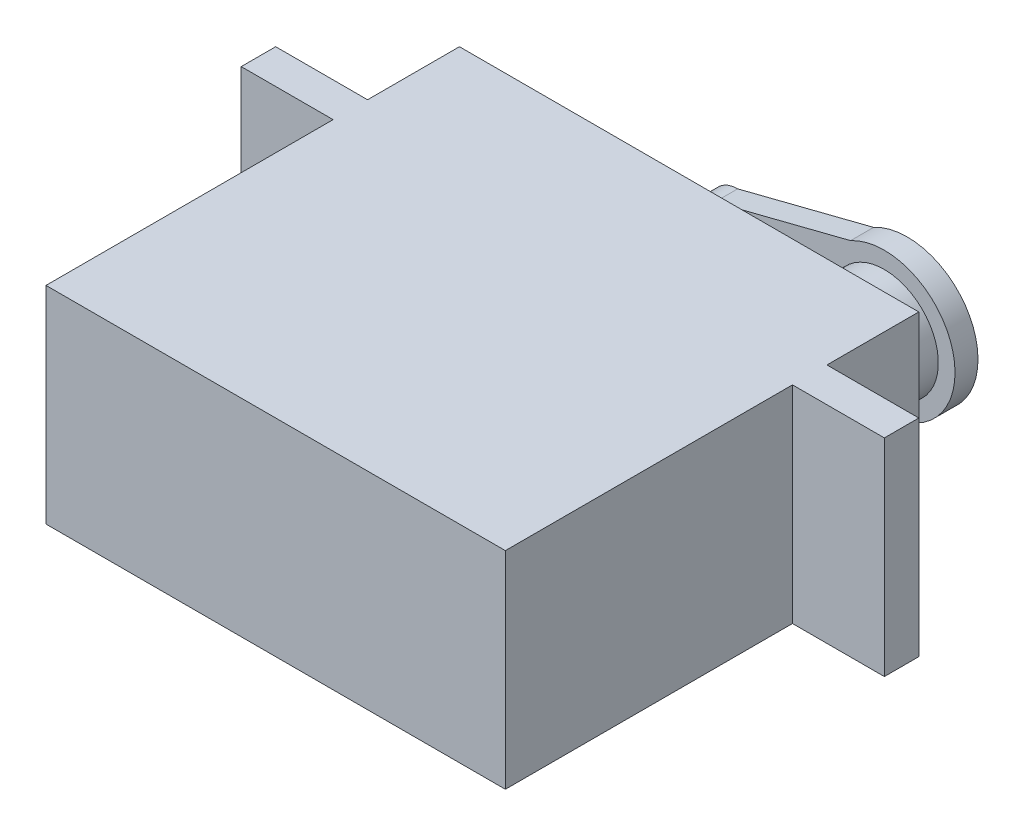
ISO-10303-21;
HEADER;
FILE_DESCRIPTION(('STEP AP214'),'2;1');
FILE_NAME('part.step','',(''),(''),'','','');
FILE_SCHEMA(('AUTOMOTIVE_DESIGN { 1 0 10303 214 1 1 1 1 }'));
ENDSEC;
DATA;
#1=APPLICATION_CONTEXT('core data for automotive mechanical design processes');
#2=APPLICATION_PROTOCOL_DEFINITION('international standard','automotive_design',2000,#1);
#3=PRODUCT_CONTEXT('',#1,'mechanical');
#4=PRODUCT('Part','Part','',(#3));
#5=PRODUCT_RELATED_PRODUCT_CATEGORY('part','',(#4));
#6=PRODUCT_DEFINITION_FORMATION('','',#4);
#7=PRODUCT_DEFINITION_CONTEXT('part definition',#1,'design');
#8=PRODUCT_DEFINITION('design','',#6,#7);
#9=PRODUCT_DEFINITION_SHAPE('','',#8);
#10=(LENGTH_UNIT() NAMED_UNIT(*) SI_UNIT(.MILLI.,.METRE.));
#11=(NAMED_UNIT(*) PLANE_ANGLE_UNIT() SI_UNIT($,.RADIAN.));
#12=(NAMED_UNIT(*) SI_UNIT($,.STERADIAN.) SOLID_ANGLE_UNIT());
#13=UNCERTAINTY_MEASURE_WITH_UNIT(LENGTH_MEASURE(1.E-05),#10,'distance_accuracy_value','');
#14=(GEOMETRIC_REPRESENTATION_CONTEXT(3) GLOBAL_UNCERTAINTY_ASSIGNED_CONTEXT((#13)) GLOBAL_UNIT_ASSIGNED_CONTEXT((#10,
#11,#12)) REPRESENTATION_CONTEXT('',''));
#15=CARTESIAN_POINT('',(0.,0.,0.));
#16=DIRECTION('',(0.,0.,1.));
#17=DIRECTION('',(1.,0.,0.));
#18=AXIS2_PLACEMENT_3D('',#15,#16,#17);
#19=CARTESIAN_POINT('',(0.,0.,0.));
#20=DIRECTION('',(0.,0.,1.));
#21=DIRECTION('',(1.,0.,0.));
#22=AXIS2_PLACEMENT_3D('',#19,#20,#21);
#23=PLANE('',#22);
#24=DIRECTION('',(1.,0.,0.));
#25=VECTOR('',#24,1.);
#26=CARTESIAN_POINT('',(-56.,0.,0.));
#27=LINE('',#26,#25);
#28=CARTESIAN_POINT('',(-8.,0.,0.));
#29=VERTEX_POINT('',#28);
#30=CARTESIAN_POINT('',(0.,0.,0.));
#31=VERTEX_POINT('',#30);
#32=EDGE_CURVE('E256',#29,#31,#27,.T.);
#33=ORIENTED_EDGE('',*,*,#32,.F.);
#34=DIRECTION('',(0.,1.,0.));
#35=VECTOR('',#34,1.);
#36=CARTESIAN_POINT('',(-8.,0.,0.));
#37=LINE('',#36,#35);
#38=CARTESIAN_POINT('',(-8.,18.,0.));
#39=VERTEX_POINT('',#38);
#40=EDGE_CURVE('E189',#29,#39,#37,.T.);
#41=ORIENTED_EDGE('',*,*,#40,.T.);
#42=DIRECTION('',(-1.,0.,0.));
#43=VECTOR('',#42,1.);
#44=CARTESIAN_POINT('',(0.,18.,0.));
#45=LINE('',#44,#43);
#46=CARTESIAN_POINT('',(0.,18.,0.));
#47=VERTEX_POINT('',#46);
#48=EDGE_CURVE('E251',#47,#39,#45,.T.);
#49=ORIENTED_EDGE('',*,*,#48,.F.);
#50=DIRECTION('',(0.,1.,0.));
#51=VECTOR('',#50,1.);
#52=CARTESIAN_POINT('',(0.,0.,0.));
#53=LINE('',#52,#51);
#54=EDGE_CURVE('E232',#31,#47,#53,.T.);
#55=ORIENTED_EDGE('',*,*,#54,.F.);
#56=EDGE_LOOP('',(#33,#41,#49,#55));
#57=FACE_BOUND('',#56,.T.);
#58=ADVANCED_FACE('F37',(#57),#23,.F.);
#59=CARTESIAN_POINT('',(0.,0.,3.));
#60=DIRECTION('',(0.,0.,1.));
#61=DIRECTION('',(1.,0.,0.));
#62=AXIS2_PLACEMENT_3D('',#59,#60,#61);
#63=PLANE('',#62);
#64=DIRECTION('',(1.,0.,0.));
#65=VECTOR('',#64,1.);
#66=CARTESIAN_POINT('',(-56.,0.,3.));
#67=LINE('',#66,#65);
#68=CARTESIAN_POINT('',(-56.,0.,3.));
#69=VERTEX_POINT('',#68);
#70=CARTESIAN_POINT('',(-48.,0.,3.));
#71=VERTEX_POINT('',#70);
#72=EDGE_CURVE('E244',#69,#71,#67,.T.);
#73=ORIENTED_EDGE('',*,*,#72,.T.);
#74=DIRECTION('',(0.,1.,0.));
#75=VECTOR('',#74,1.);
#76=CARTESIAN_POINT('',(-48.,0.,3.));
#77=LINE('',#76,#75);
#78=CARTESIAN_POINT('',(-48.,18.,3.));
#79=VERTEX_POINT('',#78);
#80=EDGE_CURVE('E211',#71,#79,#77,.T.);
#81=ORIENTED_EDGE('',*,*,#80,.T.);
#82=DIRECTION('',(-1.,0.,0.));
#83=VECTOR('',#82,1.);
#84=CARTESIAN_POINT('',(0.,18.,3.));
#85=LINE('',#84,#83);
#86=CARTESIAN_POINT('',(-56.,18.,3.));
#87=VERTEX_POINT('',#86);
#88=EDGE_CURVE('E236',#79,#87,#85,.T.);
#89=ORIENTED_EDGE('',*,*,#88,.T.);
#90=DIRECTION('',(0.,-1.,0.));
#91=VECTOR('',#90,1.);
#92=CARTESIAN_POINT('',(-56.,18.,3.));
#93=LINE('',#92,#91);
#94=EDGE_CURVE('E241',#87,#69,#93,.T.);
#95=ORIENTED_EDGE('',*,*,#94,.T.);
#96=EDGE_LOOP('',(#73,#81,#89,#95));
#97=FACE_BOUND('',#96,.T.);
#98=ADVANCED_FACE('F283',(#97),#63,.T.);
#99=CARTESIAN_POINT('',(0.,18.,3.));
#100=VERTEX_POINT('',#99);
#101=CARTESIAN_POINT('',(-8.,18.,3.));
#102=VERTEX_POINT('',#101);
#103=EDGE_CURVE('E238',#100,#102,#85,.T.);
#104=ORIENTED_EDGE('',*,*,#103,.T.);
#105=DIRECTION('',(0.,-1.,0.));
#106=VECTOR('',#105,1.);
#107=CARTESIAN_POINT('',(-8.,0.,3.));
#108=LINE('',#107,#106);
#109=CARTESIAN_POINT('',(-8.,0.,3.));
#110=VERTEX_POINT('',#109);
#111=EDGE_CURVE('E216',#102,#110,#108,.T.);
#112=ORIENTED_EDGE('',*,*,#111,.T.);
#113=CARTESIAN_POINT('',(0.,0.,3.));
#114=VERTEX_POINT('',#113);
#115=EDGE_CURVE('E243',#110,#114,#67,.T.);
#116=ORIENTED_EDGE('',*,*,#115,.T.);
#117=DIRECTION('',(0.,1.,0.));
#118=VECTOR('',#117,1.);
#119=CARTESIAN_POINT('',(0.,0.,3.));
#120=LINE('',#119,#118);
#121=EDGE_CURVE('E233',#114,#100,#120,.T.);
#122=ORIENTED_EDGE('',*,*,#121,.T.);
#123=EDGE_LOOP('',(#104,#112,#116,#122));
#124=FACE_BOUND('',#123,.T.);
#125=ADVANCED_FACE('F297',(#124),#63,.T.);
#126=CARTESIAN_POINT('',(0.,0.,3.));
#127=DIRECTION('',(-1.,0.,0.));
#128=DIRECTION('',(0.,0.,1.));
#129=AXIS2_PLACEMENT_3D('',#126,#127,#128);
#130=PLANE('',#129);
#131=ORIENTED_EDGE('',*,*,#54,.T.);
#132=DIRECTION('',(0.,0.,-1.));
#133=VECTOR('',#132,1.);
#134=CARTESIAN_POINT('',(0.,18.,3.));
#135=LINE('',#134,#133);
#136=EDGE_CURVE('E11',#100,#47,#135,.T.);
#137=ORIENTED_EDGE('',*,*,#136,.F.);
#138=ORIENTED_EDGE('',*,*,#121,.F.);
#139=DIRECTION('',(0.,0.,-1.));
#140=VECTOR('',#139,1.);
#141=CARTESIAN_POINT('',(0.,0.,3.));
#142=LINE('',#141,#140);
#143=EDGE_CURVE('E247',#114,#31,#142,.T.);
#144=ORIENTED_EDGE('',*,*,#143,.T.);
#145=EDGE_LOOP('',(#131,#137,#138,#144));
#146=FACE_BOUND('',#145,.T.);
#147=ADVANCED_FACE('F39',(#146),#130,.F.);
#148=CARTESIAN_POINT('',(0.,18.,3.));
#149=DIRECTION('',(0.,-1.,0.));
#150=DIRECTION('',(1.,0.,0.));
#151=AXIS2_PLACEMENT_3D('',#148,#149,#150);
#152=PLANE('',#151);
#153=ORIENTED_EDGE('',*,*,#48,.T.);
#154=DIRECTION('',(0.,0.,1.));
#155=VECTOR('',#154,1.);
#156=CARTESIAN_POINT('',(-8.,18.,-8.));
#157=LINE('',#156,#155);
#158=CARTESIAN_POINT('',(-8.,18.,-8.));
#159=VERTEX_POINT('',#158);
#160=EDGE_CURVE('E201',#159,#39,#157,.T.);
#161=ORIENTED_EDGE('',*,*,#160,.F.);
#162=DIRECTION('',(1.,0.,0.));
#163=VECTOR('',#162,1.);
#164=CARTESIAN_POINT('',(0.,18.,-8.));
#165=LINE('',#164,#163);
#166=CARTESIAN_POINT('',(-48.,18.,-8.));
#167=VERTEX_POINT('',#166);
#168=EDGE_CURVE('E199',#167,#159,#165,.T.);
#169=ORIENTED_EDGE('',*,*,#168,.F.);
#170=DIRECTION('',(0.,0.,1.));
#171=VECTOR('',#170,1.);
#172=CARTESIAN_POINT('',(-48.,18.,-8.));
#173=LINE('',#172,#171);
#174=CARTESIAN_POINT('',(-48.,18.,0.));
#175=VERTEX_POINT('',#174);
#176=EDGE_CURVE('E206',#167,#175,#173,.T.);
#177=ORIENTED_EDGE('',*,*,#176,.T.);
#178=CARTESIAN_POINT('',(-56.,18.,0.));
#179=VERTEX_POINT('',#178);
#180=EDGE_CURVE('E250',#175,#179,#45,.T.);
#181=ORIENTED_EDGE('',*,*,#180,.T.);
#182=DIRECTION('',(0.,0.,-1.));
#183=VECTOR('',#182,1.);
#184=CARTESIAN_POINT('',(-56.,18.,3.));
#185=LINE('',#184,#183);
#186=EDGE_CURVE('E45',#87,#179,#185,.T.);
#187=ORIENTED_EDGE('',*,*,#186,.F.);
#188=ORIENTED_EDGE('',*,*,#88,.F.);
#189=DIRECTION('',(0.,0.,-1.));
#190=VECTOR('',#189,1.);
#191=CARTESIAN_POINT('',(-48.,18.,28.));
#192=LINE('',#191,#190);
#193=CARTESIAN_POINT('',(-48.,18.,28.));
#194=VERTEX_POINT('',#193);
#195=EDGE_CURVE('E222',#194,#79,#192,.T.);
#196=ORIENTED_EDGE('',*,*,#195,.F.);
#197=DIRECTION('',(-1.,0.,0.));
#198=VECTOR('',#197,1.);
#199=CARTESIAN_POINT('',(0.,18.,28.));
#200=LINE('',#199,#198);
#201=CARTESIAN_POINT('',(-8.,18.,28.));
#202=VERTEX_POINT('',#201);
#203=EDGE_CURVE('E220',#202,#194,#200,.T.);
#204=ORIENTED_EDGE('',*,*,#203,.F.);
#205=DIRECTION('',(0.,0.,-1.));
#206=VECTOR('',#205,1.);
#207=CARTESIAN_POINT('',(-8.,18.,28.));
#208=LINE('',#207,#206);
#209=EDGE_CURVE('E227',#202,#102,#208,.T.);
#210=ORIENTED_EDGE('',*,*,#209,.T.);
#211=ORIENTED_EDGE('',*,*,#103,.F.);
#212=ORIENTED_EDGE('',*,*,#136,.T.);
#213=EDGE_LOOP('',(#153,#161,#169,#177,#181,#187,#188,#196,#204,#210,#211,#212));
#214=FACE_BOUND('',#213,.T.);
#215=ADVANCED_FACE('F285',(#214),#152,.F.);
#216=CARTESIAN_POINT('',(-56.,18.,3.));
#217=DIRECTION('',(1.,0.,0.));
#218=DIRECTION('',(0.,0.,-1.));
#219=AXIS2_PLACEMENT_3D('',#216,#217,#218);
#220=PLANE('',#219);
#221=DIRECTION('',(0.,-1.,0.));
#222=VECTOR('',#221,1.);
#223=CARTESIAN_POINT('',(-56.,18.,0.));
#224=LINE('',#223,#222);
#225=CARTESIAN_POINT('',(-56.,0.,0.));
#226=VERTEX_POINT('',#225);
#227=EDGE_CURVE('E254',#179,#226,#224,.T.);
#228=ORIENTED_EDGE('',*,*,#227,.T.);
#229=DIRECTION('',(0.,0.,-1.));
#230=VECTOR('',#229,1.);
#231=CARTESIAN_POINT('',(-56.,0.,3.));
#232=LINE('',#231,#230);
#233=EDGE_CURVE('E261',#69,#226,#232,.T.);
#234=ORIENTED_EDGE('',*,*,#233,.F.);
#235=ORIENTED_EDGE('',*,*,#94,.F.);
#236=ORIENTED_EDGE('',*,*,#186,.T.);
#237=EDGE_LOOP('',(#228,#234,#235,#236));
#238=FACE_BOUND('',#237,.T.);
#239=ADVANCED_FACE('F268',(#238),#220,.F.);
#240=CARTESIAN_POINT('',(-56.,0.,3.));
#241=DIRECTION('',(0.,1.,0.));
#242=DIRECTION('',(0.,0.,1.));
#243=AXIS2_PLACEMENT_3D('',#240,#241,#242);
#244=PLANE('',#243);
#245=CARTESIAN_POINT('',(-48.,0.,0.));
#246=VERTEX_POINT('',#245);
#247=EDGE_CURVE('E237',#226,#246,#27,.T.);
#248=ORIENTED_EDGE('',*,*,#247,.T.);
#249=DIRECTION('',(0.,0.,1.));
#250=VECTOR('',#249,1.);
#251=CARTESIAN_POINT('',(-48.,0.,-8.));
#252=LINE('',#251,#250);
#253=CARTESIAN_POINT('',(-48.,0.,-8.));
#254=VERTEX_POINT('',#253);
#255=EDGE_CURVE('E52',#254,#246,#252,.T.);
#256=ORIENTED_EDGE('',*,*,#255,.F.);
#257=DIRECTION('',(-1.,0.,0.));
#258=VECTOR('',#257,1.);
#259=CARTESIAN_POINT('',(0.,0.,-8.));
#260=LINE('',#259,#258);
#261=CARTESIAN_POINT('',(-8.,0.,-8.));
#262=VERTEX_POINT('',#261);
#263=EDGE_CURVE('E194',#262,#254,#260,.T.);
#264=ORIENTED_EDGE('',*,*,#263,.F.);
#265=DIRECTION('',(0.,0.,1.));
#266=VECTOR('',#265,1.);
#267=CARTESIAN_POINT('',(-8.,0.,-8.));
#268=LINE('',#267,#266);
#269=EDGE_CURVE('E209',#262,#29,#268,.T.);
#270=ORIENTED_EDGE('',*,*,#269,.T.);
#271=ORIENTED_EDGE('',*,*,#32,.T.);
#272=ORIENTED_EDGE('',*,*,#143,.F.);
#273=ORIENTED_EDGE('',*,*,#115,.F.);
#274=DIRECTION('',(0.,0.,-1.));
#275=VECTOR('',#274,1.);
#276=CARTESIAN_POINT('',(-8.,0.,28.));
#277=LINE('',#276,#275);
#278=CARTESIAN_POINT('',(-8.,0.,28.));
#279=VERTEX_POINT('',#278);
#280=EDGE_CURVE('E60',#279,#110,#277,.T.);
#281=ORIENTED_EDGE('',*,*,#280,.F.);
#282=DIRECTION('',(1.,0.,0.));
#283=VECTOR('',#282,1.);
#284=CARTESIAN_POINT('',(0.,0.,28.));
#285=LINE('',#284,#283);
#286=CARTESIAN_POINT('',(-48.,0.,28.));
#287=VERTEX_POINT('',#286);
#288=EDGE_CURVE('E215',#287,#279,#285,.T.);
#289=ORIENTED_EDGE('',*,*,#288,.F.);
#290=DIRECTION('',(0.,0.,-1.));
#291=VECTOR('',#290,1.);
#292=CARTESIAN_POINT('',(-48.,0.,28.));
#293=LINE('',#292,#291);
#294=EDGE_CURVE('E230',#287,#71,#293,.T.);
#295=ORIENTED_EDGE('',*,*,#294,.T.);
#296=ORIENTED_EDGE('',*,*,#72,.F.);
#297=ORIENTED_EDGE('',*,*,#233,.T.);
#298=EDGE_LOOP('',(#248,#256,#264,#270,#271,#272,#273,#281,#289,#295,#296,#297));
#299=FACE_BOUND('',#298,.T.);
#300=ADVANCED_FACE('F277',(#299),#244,.F.);
#301=ORIENTED_EDGE('',*,*,#180,.F.);
#302=DIRECTION('',(0.,-1.,0.));
#303=VECTOR('',#302,1.);
#304=CARTESIAN_POINT('',(-48.,0.,0.));
#305=LINE('',#304,#303);
#306=EDGE_CURVE('E195',#175,#246,#305,.T.);
#307=ORIENTED_EDGE('',*,*,#306,.T.);
#308=ORIENTED_EDGE('',*,*,#247,.F.);
#309=ORIENTED_EDGE('',*,*,#227,.F.);
#310=EDGE_LOOP('',(#301,#307,#308,#309));
#311=FACE_BOUND('',#310,.T.);
#312=ADVANCED_FACE('F275',(#311),#23,.F.);
#313=CARTESIAN_POINT('',(-48.,0.,28.));
#314=DIRECTION('',(-1.,0.,0.));
#315=DIRECTION('',(0.,0.,1.));
#316=AXIS2_PLACEMENT_3D('',#313,#314,#315);
#317=PLANE('',#316);
#318=ORIENTED_EDGE('',*,*,#80,.F.);
#319=ORIENTED_EDGE('',*,*,#294,.F.);
#320=DIRECTION('',(0.,1.,0.));
#321=VECTOR('',#320,1.);
#322=CARTESIAN_POINT('',(-48.,0.,28.));
#323=LINE('',#322,#321);
#324=EDGE_CURVE('E212',#287,#194,#323,.T.);
#325=ORIENTED_EDGE('',*,*,#324,.T.);
#326=ORIENTED_EDGE('',*,*,#195,.T.);
#327=EDGE_LOOP('',(#318,#319,#325,#326));
#328=FACE_BOUND('',#327,.T.);
#329=ADVANCED_FACE('F290',(#328),#317,.T.);
#330=CARTESIAN_POINT('',(-8.,0.,28.));
#331=DIRECTION('',(1.,0.,0.));
#332=DIRECTION('',(0.,0.,-1.));
#333=AXIS2_PLACEMENT_3D('',#330,#331,#332);
#334=PLANE('',#333);
#335=ORIENTED_EDGE('',*,*,#111,.F.);
#336=ORIENTED_EDGE('',*,*,#209,.F.);
#337=DIRECTION('',(0.,-1.,0.));
#338=VECTOR('',#337,1.);
#339=CARTESIAN_POINT('',(-8.,0.,28.));
#340=LINE('',#339,#338);
#341=EDGE_CURVE('E218',#202,#279,#340,.T.);
#342=ORIENTED_EDGE('',*,*,#341,.T.);
#343=ORIENTED_EDGE('',*,*,#280,.T.);
#344=EDGE_LOOP('',(#335,#336,#342,#343));
#345=FACE_BOUND('',#344,.T.);
#346=ADVANCED_FACE('F293',(#345),#334,.T.);
#347=CARTESIAN_POINT('',(0.,0.,28.));
#348=DIRECTION('',(0.,0.,1.));
#349=DIRECTION('',(1.,0.,0.));
#350=AXIS2_PLACEMENT_3D('',#347,#348,#349);
#351=PLANE('',#350);
#352=ORIENTED_EDGE('',*,*,#324,.F.);
#353=ORIENTED_EDGE('',*,*,#288,.T.);
#354=ORIENTED_EDGE('',*,*,#341,.F.);
#355=ORIENTED_EDGE('',*,*,#203,.T.);
#356=EDGE_LOOP('',(#352,#353,#354,#355));
#357=FACE_BOUND('',#356,.T.);
#358=ADVANCED_FACE('F292',(#357),#351,.T.);
#359=CARTESIAN_POINT('',(-8.,0.,-8.));
#360=DIRECTION('',(1.,0.,0.));
#361=DIRECTION('',(0.,0.,-1.));
#362=AXIS2_PLACEMENT_3D('',#359,#360,#361);
#363=PLANE('',#362);
#364=ORIENTED_EDGE('',*,*,#40,.F.);
#365=ORIENTED_EDGE('',*,*,#269,.F.);
#366=DIRECTION('',(0.,1.,0.));
#367=VECTOR('',#366,1.);
#368=CARTESIAN_POINT('',(-8.,0.,-8.));
#369=LINE('',#368,#367);
#370=EDGE_CURVE('E191',#262,#159,#369,.T.);
#371=ORIENTED_EDGE('',*,*,#370,.T.);
#372=ORIENTED_EDGE('',*,*,#160,.T.);
#373=EDGE_LOOP('',(#364,#365,#371,#372));
#374=FACE_BOUND('',#373,.T.);
#375=ADVANCED_FACE('F310',(#374),#363,.T.);
#376=CARTESIAN_POINT('',(-48.,0.,-8.));
#377=DIRECTION('',(-1.,0.,0.));
#378=DIRECTION('',(0.,0.,1.));
#379=AXIS2_PLACEMENT_3D('',#376,#377,#378);
#380=PLANE('',#379);
#381=ORIENTED_EDGE('',*,*,#306,.F.);
#382=ORIENTED_EDGE('',*,*,#176,.F.);
#383=DIRECTION('',(0.,-1.,0.));
#384=VECTOR('',#383,1.);
#385=CARTESIAN_POINT('',(-48.,0.,-8.));
#386=LINE('',#385,#384);
#387=EDGE_CURVE('E197',#167,#254,#386,.T.);
#388=ORIENTED_EDGE('',*,*,#387,.T.);
#389=ORIENTED_EDGE('',*,*,#255,.T.);
#390=EDGE_LOOP('',(#381,#382,#388,#389));
#391=FACE_BOUND('',#390,.T.);
#392=ADVANCED_FACE('F313',(#391),#380,.T.);
#393=CARTESIAN_POINT('',(0.,0.,-8.));
#394=DIRECTION('',(0.,0.,-1.));
#395=DIRECTION('',(-1.,0.,0.));
#396=AXIS2_PLACEMENT_3D('',#393,#394,#395);
#397=PLANE('',#396);
#398=CARTESIAN_POINT('',(-17.,9.,-8.));
#399=DIRECTION('',(0.,0.,-1.));
#400=DIRECTION('',(-1.,0.,0.));
#401=AXIS2_PLACEMENT_3D('',#398,#399,#400);
#402=CIRCLE('',#401,4.7);
#403=CARTESIAN_POINT('',(-21.7,9.,-8.));
#404=VERTEX_POINT('',#403);
#405=EDGE_CURVE('E179',#404,#404,#402,.T.);
#406=ORIENTED_EDGE('',*,*,#405,.F.);
#407=EDGE_LOOP('',(#406));
#408=FACE_BOUND('',#407,.T.);
#409=ORIENTED_EDGE('',*,*,#370,.F.);
#410=ORIENTED_EDGE('',*,*,#263,.T.);
#411=ORIENTED_EDGE('',*,*,#387,.F.);
#412=ORIENTED_EDGE('',*,*,#168,.T.);
#413=EDGE_LOOP('',(#409,#410,#411,#412));
#414=FACE_BOUND('',#413,.T.);
#415=ADVANCED_FACE('F312',(#408,#414),#397,.T.);
#416=CARTESIAN_POINT('',(-17.,9.,-14.));
#417=DIRECTION('',(0.,0.,1.));
#418=DIRECTION('',(1.,0.,0.));
#419=AXIS2_PLACEMENT_3D('',#416,#417,#418);
#420=CYLINDRICAL_SURFACE('',#419,4.7);
#421=CARTESIAN_POINT('',(-17.,9.,-14.));
#422=DIRECTION('',(0.,0.,-1.));
#423=DIRECTION('',(-1.,0.,0.));
#424=AXIS2_PLACEMENT_3D('',#421,#422,#423);
#425=CIRCLE('',#424,4.7);
#426=CARTESIAN_POINT('',(-21.7,9.,-14.));
#427=VERTEX_POINT('',#426);
#428=EDGE_CURVE('E182',#427,#427,#425,.T.);
#429=ORIENTED_EDGE('',*,*,#428,.F.);
#430=EDGE_LOOP('',(#429));
#431=FACE_BOUND('',#430,.T.);
#432=ORIENTED_EDGE('',*,*,#405,.T.);
#433=EDGE_LOOP('',(#432));
#434=FACE_BOUND('',#433,.T.);
#435=ADVANCED_FACE('F320',(#431,#434),#420,.T.);
#436=CARTESIAN_POINT('',(-17.,9.,-16.));
#437=DIRECTION('',(0.,0.,1.));
#438=DIRECTION('',(1.,0.,0.));
#439=AXIS2_PLACEMENT_3D('',#436,#437,#438);
#440=CYLINDRICAL_SURFACE('',#439,6.15460775731117);
#441=CARTESIAN_POINT('',(-17.,9.,-14.));
#442=DIRECTION('',(0.,0.,-1.));
#443=DIRECTION('',(-1.,0.,0.));
#444=AXIS2_PLACEMENT_3D('',#441,#442,#443);
#445=CIRCLE('',#444,6.15460775731117);
#446=CARTESIAN_POINT('',(-19.9412941743127,14.4062912635659,-14.));
#447=VERTEX_POINT('',#446);
#448=CARTESIAN_POINT('',(-19.9412941743127,3.59370873643411,-14.));
#449=VERTEX_POINT('',#448);
#450=EDGE_CURVE('E178',#447,#449,#445,.T.);
#451=ORIENTED_EDGE('',*,*,#450,.T.);
#452=DIRECTION('',(0.,0.,1.));
#453=VECTOR('',#452,1.);
#454=CARTESIAN_POINT('',(-19.9412941743127,3.59370873643411,-16.));
#455=LINE('',#454,#453);
#456=CARTESIAN_POINT('',(-19.9412941743127,3.59370873643411,-16.));
#457=VERTEX_POINT('',#456);
#458=EDGE_CURVE('E158',#457,#449,#455,.T.);
#459=ORIENTED_EDGE('',*,*,#458,.F.);
#460=CARTESIAN_POINT('',(-17.,9.,-16.));
#461=DIRECTION('',(0.,0.,-1.));
#462=DIRECTION('',(-1.,0.,0.));
#463=AXIS2_PLACEMENT_3D('',#460,#461,#462);
#464=CIRCLE('',#463,6.15460775731117);
#465=CARTESIAN_POINT('',(-19.9412941743127,14.4062912635659,-16.));
#466=VERTEX_POINT('',#465);
#467=EDGE_CURVE('E165',#466,#457,#464,.T.);
#468=ORIENTED_EDGE('',*,*,#467,.F.);
#469=DIRECTION('',(0.,0.,1.));
#470=VECTOR('',#469,1.);
#471=CARTESIAN_POINT('',(-19.9412941743127,14.4062912635659,-16.));
#472=LINE('',#471,#470);
#473=EDGE_CURVE('E455',#466,#447,#472,.T.);
#474=ORIENTED_EDGE('',*,*,#473,.T.);
#475=EDGE_LOOP('',(#451,#459,#468,#474));
#476=FACE_BOUND('',#475,.T.);
#477=ADVANCED_FACE('F176',(#476),#440,.T.);
#478=CARTESIAN_POINT('',(-31.7702920262685,6.60321192533712,-16.));
#479=DIRECTION('',(0.246562753304745,0.969126827965661,0.));
#480=DIRECTION('',(-0.969126827965661,0.246562753304745,0.));
#481=AXIS2_PLACEMENT_3D('',#478,#479,#480);
#482=PLANE('',#481);
#483=DIRECTION('',(-0.969126827965661,0.246562753304745,0.));
#484=VECTOR('',#483,1.);
#485=CARTESIAN_POINT('',(-31.7702920262685,6.60321192533712,-14.));
#486=LINE('',#485,#484);
#487=CARTESIAN_POINT('',(-31.7702920262685,6.60321192533712,-14.));
#488=VERTEX_POINT('',#487);
#489=EDGE_CURVE('E446',#449,#488,#486,.T.);
#490=ORIENTED_EDGE('',*,*,#489,.T.);
#491=DIRECTION('',(0.,0.,1.));
#492=VECTOR('',#491,1.);
#493=CARTESIAN_POINT('',(-31.7702920262685,6.60321192533712,-16.));
#494=LINE('',#493,#492);
#495=CARTESIAN_POINT('',(-31.7702920262685,6.60321192533712,-16.));
#496=VERTEX_POINT('',#495);
#497=EDGE_CURVE('E161',#496,#488,#494,.T.);
#498=ORIENTED_EDGE('',*,*,#497,.F.);
#499=DIRECTION('',(-0.969126827965661,0.246562753304745,0.));
#500=VECTOR('',#499,1.);
#501=CARTESIAN_POINT('',(-31.7702920262685,6.60321192533712,-16.));
#502=LINE('',#501,#500);
#503=EDGE_CURVE('E154',#457,#496,#502,.T.);
#504=ORIENTED_EDGE('',*,*,#503,.F.);
#505=ORIENTED_EDGE('',*,*,#458,.T.);
#506=EDGE_LOOP('',(#490,#498,#504,#505));
#507=FACE_BOUND('',#506,.T.);
#508=ADVANCED_FACE('F156',(#507),#482,.F.);
#509=CARTESIAN_POINT('',(-31.7702920262685,9.,-16.));
#510=DIRECTION('',(0.,0.,1.));
#511=DIRECTION('',(1.,0.,0.));
#512=AXIS2_PLACEMENT_3D('',#509,#510,#511);
#513=CYLINDRICAL_SURFACE('',#512,2.39678807466288);
#514=CARTESIAN_POINT('',(-31.7702920262685,9.,-14.));
#515=DIRECTION('',(0.,0.,-1.));
#516=DIRECTION('',(-1.,0.,0.));
#517=AXIS2_PLACEMENT_3D('',#514,#515,#516);
#518=CIRCLE('',#517,2.39678807466288);
#519=CARTESIAN_POINT('',(-31.7702920262685,11.3967880746629,-14.));
#520=VERTEX_POINT('',#519);
#521=EDGE_CURVE('E448',#488,#520,#518,.T.);
#522=ORIENTED_EDGE('',*,*,#521,.T.);
#523=DIRECTION('',(0.,0.,1.));
#524=VECTOR('',#523,1.);
#525=CARTESIAN_POINT('',(-31.7702920262685,11.3967880746629,-16.));
#526=LINE('',#525,#524);
#527=CARTESIAN_POINT('',(-31.7702920262685,11.3967880746629,-16.));
#528=VERTEX_POINT('',#527);
#529=EDGE_CURVE('E184',#528,#520,#526,.T.);
#530=ORIENTED_EDGE('',*,*,#529,.F.);
#531=CARTESIAN_POINT('',(-31.7702920262685,9.,-16.));
#532=DIRECTION('',(0.,0.,-1.));
#533=DIRECTION('',(-1.,0.,0.));
#534=AXIS2_PLACEMENT_3D('',#531,#532,#533);
#535=CIRCLE('',#534,2.39678807466288);
#536=EDGE_CURVE('E164',#496,#528,#535,.T.);
#537=ORIENTED_EDGE('',*,*,#536,.F.);
#538=ORIENTED_EDGE('',*,*,#497,.T.);
#539=EDGE_LOOP('',(#522,#530,#537,#538));
#540=FACE_BOUND('',#539,.T.);
#541=ADVANCED_FACE('F401',(#540),#513,.T.);
#542=CARTESIAN_POINT('',(-19.9412941743127,14.4062912635659,-16.));
#543=DIRECTION('',(0.246562753304744,-0.969126827965661,0.));
#544=DIRECTION('',(0.969126827965661,0.246562753304744,0.));
#545=AXIS2_PLACEMENT_3D('',#542,#543,#544);
#546=PLANE('',#545);
#547=DIRECTION('',(0.969126827965661,0.246562753304744,0.));
#548=VECTOR('',#547,1.);
#549=CARTESIAN_POINT('',(-19.9412941743127,14.4062912635659,-14.));
#550=LINE('',#549,#548);
#551=EDGE_CURVE('E174',#520,#447,#550,.T.);
#552=ORIENTED_EDGE('',*,*,#551,.T.);
#553=ORIENTED_EDGE('',*,*,#473,.F.);
#554=DIRECTION('',(0.969126827965661,0.246562753304744,0.));
#555=VECTOR('',#554,1.);
#556=CARTESIAN_POINT('',(-19.9412941743127,14.4062912635659,-16.));
#557=LINE('',#556,#555);
#558=EDGE_CURVE('E170',#528,#466,#557,.T.);
#559=ORIENTED_EDGE('',*,*,#558,.F.);
#560=ORIENTED_EDGE('',*,*,#529,.T.);
#561=EDGE_LOOP('',(#552,#553,#559,#560));
#562=FACE_BOUND('',#561,.T.);
#563=ADVANCED_FACE('F410',(#562),#546,.F.);
#564=CARTESIAN_POINT('',(-17.,9.,-16.));
#565=DIRECTION('',(0.,0.,-1.));
#566=DIRECTION('',(-1.,0.,0.));
#567=AXIS2_PLACEMENT_3D('',#564,#565,#566);
#568=PLANE('',#567);
#569=ORIENTED_EDGE('',*,*,#467,.T.);
#570=ORIENTED_EDGE('',*,*,#503,.T.);
#571=ORIENTED_EDGE('',*,*,#536,.T.);
#572=ORIENTED_EDGE('',*,*,#558,.T.);
#573=EDGE_LOOP('',(#569,#570,#571,#572));
#574=FACE_BOUND('',#573,.T.);
#575=ADVANCED_FACE('F168',(#574),#568,.T.);
#576=CARTESIAN_POINT('',(-17.,9.,-14.));
#577=DIRECTION('',(0.,0.,-1.));
#578=DIRECTION('',(-1.,0.,0.));
#579=AXIS2_PLACEMENT_3D('',#576,#577,#578);
#580=PLANE('',#579);
#581=ORIENTED_EDGE('',*,*,#428,.T.);
#582=EDGE_LOOP('',(#581));
#583=FACE_BOUND('',#582,.T.);
#584=ORIENTED_EDGE('',*,*,#450,.F.);
#585=ORIENTED_EDGE('',*,*,#551,.F.);
#586=ORIENTED_EDGE('',*,*,#521,.F.);
#587=ORIENTED_EDGE('',*,*,#489,.F.);
#588=EDGE_LOOP('',(#584,#585,#586,#587));
#589=FACE_BOUND('',#588,.T.);
#590=ADVANCED_FACE('F429',(#583,#589),#580,.F.);
#591=CLOSED_SHELL('',(#58,#98,#125,#147,#215,#239,#300,#312,#329,#346,#358,#375,#392,#415,#435,
#477,#508,#541,#563,#575,#590));
#592=MANIFOLD_SOLID_BREP('B2',#591);
#593=ADVANCED_BREP_SHAPE_REPRESENTATION('',(#18,#592),#14);
#594=SHAPE_DEFINITION_REPRESENTATION(#9,#593);
ENDSEC;
END-ISO-10303-21;
